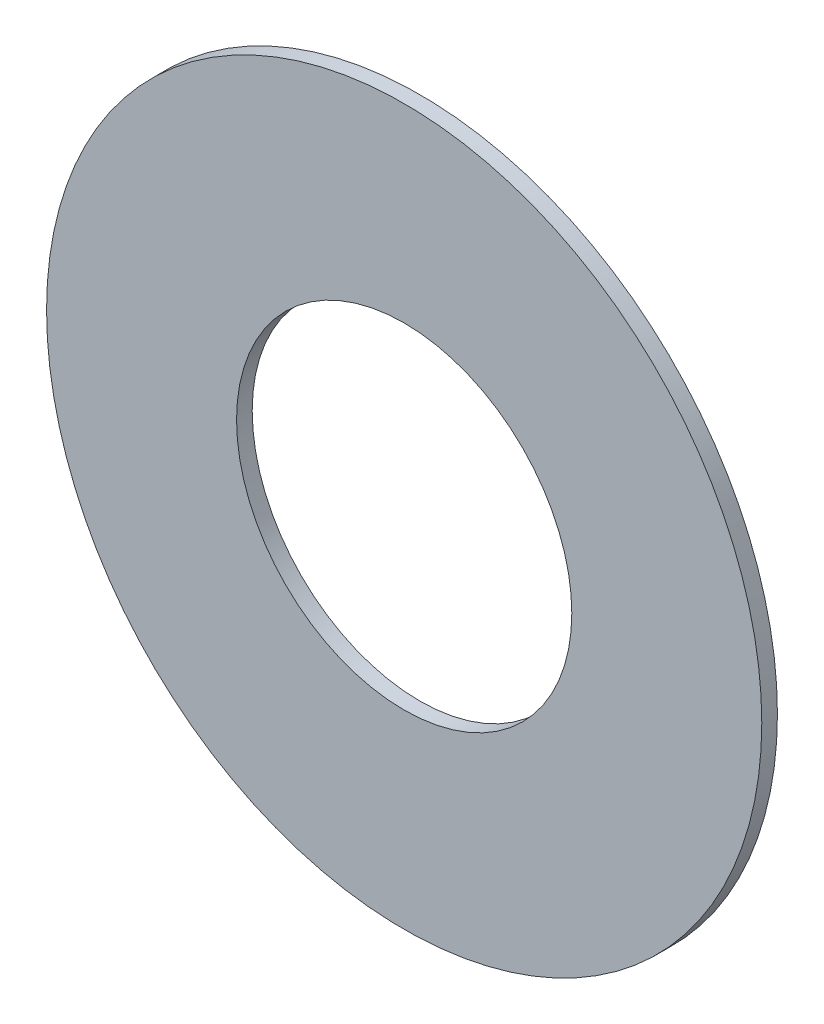
ISO-10303-21;
HEADER;
FILE_DESCRIPTION(('STEP AP214'),'2;1');
FILE_NAME('part.step','',(''),(''),'','','');
FILE_SCHEMA(('AUTOMOTIVE_DESIGN { 1 0 10303 214 1 1 1 1 }'));
ENDSEC;
DATA;
#1=APPLICATION_CONTEXT('core data for automotive mechanical design processes');
#2=APPLICATION_PROTOCOL_DEFINITION('international standard','automotive_design',2000,#1);
#3=PRODUCT_CONTEXT('',#1,'mechanical');
#4=PRODUCT('Part','Part','',(#3));
#5=PRODUCT_RELATED_PRODUCT_CATEGORY('part','',(#4));
#6=PRODUCT_DEFINITION_FORMATION('','',#4);
#7=PRODUCT_DEFINITION_CONTEXT('part definition',#1,'design');
#8=PRODUCT_DEFINITION('design','',#6,#7);
#9=PRODUCT_DEFINITION_SHAPE('','',#8);
#10=(LENGTH_UNIT() NAMED_UNIT(*) SI_UNIT(.MILLI.,.METRE.));
#11=(NAMED_UNIT(*) PLANE_ANGLE_UNIT() SI_UNIT($,.RADIAN.));
#12=(NAMED_UNIT(*) SI_UNIT($,.STERADIAN.) SOLID_ANGLE_UNIT());
#13=UNCERTAINTY_MEASURE_WITH_UNIT(LENGTH_MEASURE(1.E-05),#10,'distance_accuracy_value','');
#14=(GEOMETRIC_REPRESENTATION_CONTEXT(3) GLOBAL_UNCERTAINTY_ASSIGNED_CONTEXT((#13)) GLOBAL_UNIT_ASSIGNED_CONTEXT((#10,
#11,#12)) REPRESENTATION_CONTEXT('',''));
#15=CARTESIAN_POINT('',(0.,0.,0.));
#16=DIRECTION('',(0.,0.,1.));
#17=DIRECTION('',(1.,0.,0.));
#18=AXIS2_PLACEMENT_3D('',#15,#16,#17);
#19=CARTESIAN_POINT('',(170.307,-133.477,-0.045));
#20=DIRECTION('',(0.,0.,-1.));
#21=DIRECTION('',(0.,-1.,0.));
#22=AXIS2_PLACEMENT_3D('',#19,#20,#21);
#23=CYLINDRICAL_SURFACE('',#22,0.375);
#24=CARTESIAN_POINT('',(170.307,-133.477,-0.035));
#25=DIRECTION('',(0.,0.,-1.));
#26=DIRECTION('',(0.,-1.,0.));
#27=AXIS2_PLACEMENT_3D('',#24,#25,#26);
#28=CIRCLE('',#27,0.375);
#29=CARTESIAN_POINT('',(170.307,-133.852,-0.035));
#30=VERTEX_POINT('',#29);
#31=EDGE_CURVE('E25',#30,#30,#28,.T.);
#32=ORIENTED_EDGE('',*,*,#31,.T.);
#33=DIRECTION('',(0.,0.,1.));
#34=VECTOR('',#33,1.);
#35=CARTESIAN_POINT('',(170.307,-133.852,-0.045));
#36=LINE('',#35,#34);
#37=CARTESIAN_POINT('',(170.307,-133.852,0.));
#38=VERTEX_POINT('',#37);
#39=EDGE_CURVE('E11',#30,#38,#36,.T.);
#40=ORIENTED_EDGE('',*,*,#39,.T.);
#41=CARTESIAN_POINT('',(170.307,-133.477,0.));
#42=DIRECTION('',(0.,0.,-1.));
#43=DIRECTION('',(0.,-1.,0.));
#44=AXIS2_PLACEMENT_3D('',#41,#42,#43);
#45=CIRCLE('',#44,0.375);
#46=EDGE_CURVE('E69',#38,#38,#45,.T.);
#47=ORIENTED_EDGE('',*,*,#46,.F.);
#48=ORIENTED_EDGE('',*,*,#39,.F.);
#49=EDGE_LOOP('',(#32,#40,#47,#48));
#50=FACE_BOUND('',#49,.T.);
#51=ADVANCED_FACE('F17',(#50),#23,.F.);
#52=CARTESIAN_POINT('',(170.307,-133.477,-0.035));
#53=DIRECTION('',(0.,0.,1.));
#54=DIRECTION('',(1.,0.,0.));
#55=AXIS2_PLACEMENT_3D('',#52,#53,#54);
#56=PLANE('',#55);
#57=ORIENTED_EDGE('',*,*,#31,.F.);
#58=EDGE_LOOP('',(#57));
#59=FACE_BOUND('',#58,.T.);
#60=CARTESIAN_POINT('',(170.307,-133.477,-0.035));
#61=DIRECTION('',(0.,0.,1.));
#62=DIRECTION('',(1.,0.,0.));
#63=AXIS2_PLACEMENT_3D('',#60,#61,#62);
#64=CIRCLE('',#63,0.8);
#65=CARTESIAN_POINT('',(171.107,-133.477,-0.035));
#66=VERTEX_POINT('',#65);
#67=EDGE_CURVE('E56',#66,#66,#64,.T.);
#68=ORIENTED_EDGE('',*,*,#67,.F.);
#69=EDGE_LOOP('',(#68));
#70=FACE_BOUND('',#69,.T.);
#71=ADVANCED_FACE('F101',(#59,#70),#56,.F.);
#72=CARTESIAN_POINT('',(170.307,-133.477,0.));
#73=DIRECTION('',(0.,0.,1.));
#74=DIRECTION('',(1.,0.,0.));
#75=AXIS2_PLACEMENT_3D('',#72,#73,#74);
#76=PLANE('',#75);
#77=ORIENTED_EDGE('',*,*,#46,.T.);
#78=EDGE_LOOP('',(#77));
#79=FACE_BOUND('',#78,.T.);
#80=CARTESIAN_POINT('',(170.307,-133.477,0.));
#81=DIRECTION('',(0.,0.,1.));
#82=DIRECTION('',(1.,0.,0.));
#83=AXIS2_PLACEMENT_3D('',#80,#81,#82);
#84=CIRCLE('',#83,0.8);
#85=CARTESIAN_POINT('',(171.107,-133.477,0.));
#86=VERTEX_POINT('',#85);
#87=EDGE_CURVE('E54',#86,#86,#84,.T.);
#88=ORIENTED_EDGE('',*,*,#87,.T.);
#89=EDGE_LOOP('',(#88));
#90=FACE_BOUND('',#89,.T.);
#91=ADVANCED_FACE('F60',(#79,#90),#76,.T.);
#92=CARTESIAN_POINT('',(170.307,-133.477,-0.035));
#93=DIRECTION('',(0.,0.,1.));
#94=DIRECTION('',(1.,0.,0.));
#95=AXIS2_PLACEMENT_3D('',#92,#93,#94);
#96=CYLINDRICAL_SURFACE('',#95,0.8);
#97=ORIENTED_EDGE('',*,*,#87,.F.);
#98=DIRECTION('',(0.,0.,1.));
#99=VECTOR('',#98,1.);
#100=CARTESIAN_POINT('',(171.107,-133.477,-0.035));
#101=LINE('',#100,#99);
#102=EDGE_CURVE('E51',#66,#86,#101,.T.);
#103=ORIENTED_EDGE('',*,*,#102,.F.);
#104=ORIENTED_EDGE('',*,*,#67,.T.);
#105=ORIENTED_EDGE('',*,*,#102,.T.);
#106=EDGE_LOOP('',(#97,#103,#104,#105));
#107=FACE_BOUND('',#106,.T.);
#108=ADVANCED_FACE('F53',(#107),#96,.T.);
#109=CLOSED_SHELL('',(#51,#71,#91,#108));
#110=MANIFOLD_SOLID_BREP('B1',#109);
#111=ADVANCED_BREP_SHAPE_REPRESENTATION('',(#18,#110),#14);
#112=SHAPE_DEFINITION_REPRESENTATION(#9,#111);
ENDSEC;
END-ISO-10303-21;
